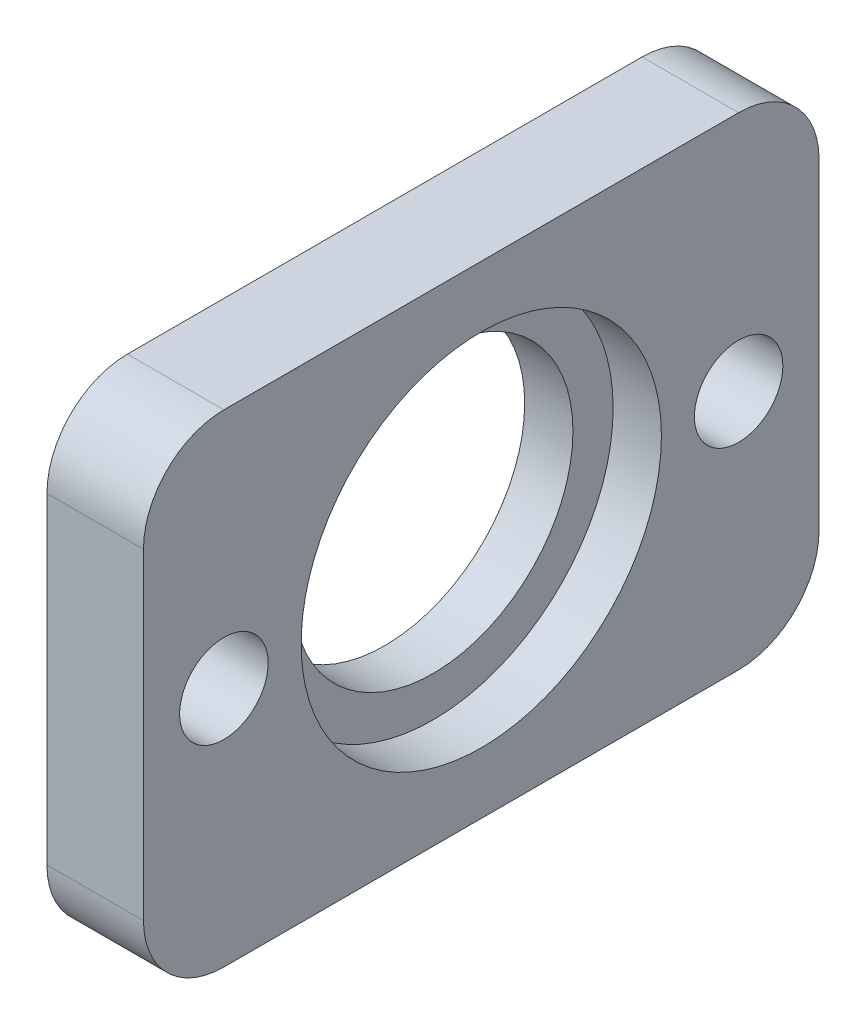
ISO-10303-21;
HEADER;
FILE_DESCRIPTION(('STEP AP214'),'2;1');
FILE_NAME('part.step','',(''),(''),'','','');
FILE_SCHEMA(('AUTOMOTIVE_DESIGN { 1 0 10303 214 1 1 1 1 }'));
ENDSEC;
DATA;
#1=APPLICATION_CONTEXT('core data for automotive mechanical design processes');
#2=APPLICATION_PROTOCOL_DEFINITION('international standard','automotive_design',2000,#1);
#3=PRODUCT_CONTEXT('',#1,'mechanical');
#4=PRODUCT('Part','Part','',(#3));
#5=PRODUCT_RELATED_PRODUCT_CATEGORY('part','',(#4));
#6=PRODUCT_DEFINITION_FORMATION('','',#4);
#7=PRODUCT_DEFINITION_CONTEXT('part definition',#1,'design');
#8=PRODUCT_DEFINITION('design','',#6,#7);
#9=PRODUCT_DEFINITION_SHAPE('','',#8);
#10=(LENGTH_UNIT() NAMED_UNIT(*) SI_UNIT(.MILLI.,.METRE.));
#11=(NAMED_UNIT(*) PLANE_ANGLE_UNIT() SI_UNIT($,.RADIAN.));
#12=(NAMED_UNIT(*) SI_UNIT($,.STERADIAN.) SOLID_ANGLE_UNIT());
#13=UNCERTAINTY_MEASURE_WITH_UNIT(LENGTH_MEASURE(1.E-05),#10,'distance_accuracy_value','');
#14=(GEOMETRIC_REPRESENTATION_CONTEXT(3) GLOBAL_UNCERTAINTY_ASSIGNED_CONTEXT((#13)) GLOBAL_UNIT_ASSIGNED_CONTEXT((#10,
#11,#12)) REPRESENTATION_CONTEXT('',''));
#15=CARTESIAN_POINT('',(0.,0.,0.));
#16=DIRECTION('',(0.,0.,1.));
#17=DIRECTION('',(1.,0.,0.));
#18=AXIS2_PLACEMENT_3D('',#15,#16,#17);
#19=CARTESIAN_POINT('',(-6.,0.,0.));
#20=DIRECTION('',(1.,0.,0.));
#21=DIRECTION('',(0.,0.,-1.));
#22=AXIS2_PLACEMENT_3D('',#19,#20,#21);
#23=CYLINDRICAL_SURFACE('',#22,8.7);
#24=CARTESIAN_POINT('',(-6.,0.,0.));
#25=DIRECTION('',(1.,0.,0.));
#26=DIRECTION('',(0.,0.,-1.));
#27=AXIS2_PLACEMENT_3D('',#24,#25,#26);
#28=CIRCLE('',#27,8.7);
#29=CARTESIAN_POINT('',(-6.,0.,-8.7));
#30=VERTEX_POINT('',#29);
#31=EDGE_CURVE('E168',#30,#30,#28,.T.);
#32=ORIENTED_EDGE('',*,*,#31,.F.);
#33=EDGE_LOOP('',(#32));
#34=FACE_BOUND('',#33,.T.);
#35=CARTESIAN_POINT('',(-3.,0.,0.));
#36=DIRECTION('',(1.,0.,0.));
#37=DIRECTION('',(0.,0.,-1.));
#38=AXIS2_PLACEMENT_3D('',#35,#36,#37);
#39=CIRCLE('',#38,8.7);
#40=CARTESIAN_POINT('',(-3.,0.,-8.7));
#41=VERTEX_POINT('',#40);
#42=EDGE_CURVE('E138',#41,#41,#39,.F.);
#43=ORIENTED_EDGE('',*,*,#42,.F.);
#44=EDGE_LOOP('',(#43));
#45=FACE_BOUND('',#44,.T.);
#46=ADVANCED_FACE('F39',(#34,#45),#23,.F.);
#47=CARTESIAN_POINT('',(-6.,-15.,-21.));
#48=DIRECTION('',(0.,0.,-1.));
#49=DIRECTION('',(0.,1.,0.));
#50=AXIS2_PLACEMENT_3D('',#47,#48,#49);
#51=PLANE('',#50);
#52=DIRECTION('',(0.,1.,0.));
#53=VECTOR('',#52,1.);
#54=CARTESIAN_POINT('',(-6.,-15.,-21.));
#55=LINE('',#54,#53);
#56=CARTESIAN_POINT('',(-6.,-10.,-21.));
#57=VERTEX_POINT('',#56);
#58=CARTESIAN_POINT('',(-6.,10.,-21.));
#59=VERTEX_POINT('',#58);
#60=EDGE_CURVE('E162',#57,#59,#55,.T.);
#61=ORIENTED_EDGE('',*,*,#60,.T.);
#62=DIRECTION('',(1.,0.,0.));
#63=VECTOR('',#62,1.);
#64=CARTESIAN_POINT('',(-6.,10.,-21.));
#65=LINE('',#64,#63);
#66=CARTESIAN_POINT('',(0.,10.,-21.));
#67=VERTEX_POINT('',#66);
#68=EDGE_CURVE('E157',#59,#67,#65,.T.);
#69=ORIENTED_EDGE('',*,*,#68,.T.);
#70=DIRECTION('',(0.,1.,0.));
#71=VECTOR('',#70,1.);
#72=CARTESIAN_POINT('',(0.,-15.,-21.));
#73=LINE('',#72,#71);
#74=CARTESIAN_POINT('',(0.,-10.,-21.));
#75=VERTEX_POINT('',#74);
#76=EDGE_CURVE('E110',#75,#67,#73,.T.);
#77=ORIENTED_EDGE('',*,*,#76,.F.);
#78=DIRECTION('',(1.,0.,0.));
#79=VECTOR('',#78,1.);
#80=CARTESIAN_POINT('',(-6.,-10.,-21.));
#81=LINE('',#80,#79);
#82=EDGE_CURVE('E155',#75,#57,#81,.F.);
#83=ORIENTED_EDGE('',*,*,#82,.T.);
#84=EDGE_LOOP('',(#61,#69,#77,#83));
#85=FACE_BOUND('',#84,.T.);
#86=ADVANCED_FACE('F160',(#85),#51,.T.);
#87=CARTESIAN_POINT('',(-6.,-15.,-21.));
#88=DIRECTION('',(0.,1.,0.));
#89=DIRECTION('',(0.,0.,1.));
#90=AXIS2_PLACEMENT_3D('',#87,#88,#89);
#91=PLANE('',#90);
#92=DIRECTION('',(0.,0.,1.));
#93=VECTOR('',#92,1.);
#94=CARTESIAN_POINT('',(-6.,-15.,-21.));
#95=LINE('',#94,#93);
#96=CARTESIAN_POINT('',(-6.,-15.,-16.));
#97=VERTEX_POINT('',#96);
#98=CARTESIAN_POINT('',(-6.,-15.,16.));
#99=VERTEX_POINT('',#98);
#100=EDGE_CURVE('E131',#97,#99,#95,.T.);
#101=ORIENTED_EDGE('',*,*,#100,.F.);
#102=DIRECTION('',(1.,0.,0.));
#103=VECTOR('',#102,1.);
#104=CARTESIAN_POINT('',(0.,-15.,-16.));
#105=LINE('',#104,#103);
#106=CARTESIAN_POINT('',(0.,-15.,-16.));
#107=VERTEX_POINT('',#106);
#108=EDGE_CURVE('E12',#97,#107,#105,.T.);
#109=ORIENTED_EDGE('',*,*,#108,.T.);
#110=DIRECTION('',(0.,0.,1.));
#111=VECTOR('',#110,1.);
#112=CARTESIAN_POINT('',(0.,-15.,-21.));
#113=LINE('',#112,#111);
#114=CARTESIAN_POINT('',(0.,-15.,16.));
#115=VERTEX_POINT('',#114);
#116=EDGE_CURVE('E164',#107,#115,#113,.T.);
#117=ORIENTED_EDGE('',*,*,#116,.T.);
#118=DIRECTION('',(1.,0.,0.));
#119=VECTOR('',#118,1.);
#120=CARTESIAN_POINT('',(-6.,-15.,16.));
#121=LINE('',#120,#119);
#122=EDGE_CURVE('E47',#115,#99,#121,.F.);
#123=ORIENTED_EDGE('',*,*,#122,.T.);
#124=EDGE_LOOP('',(#101,#109,#117,#123));
#125=FACE_BOUND('',#124,.T.);
#126=ADVANCED_FACE('F188',(#125),#91,.F.);
#127=CARTESIAN_POINT('',(-6.,-15.,21.));
#128=DIRECTION('',(0.,0.,-1.));
#129=DIRECTION('',(-1.,0.,0.));
#130=AXIS2_PLACEMENT_3D('',#127,#128,#129);
#131=PLANE('',#130);
#132=DIRECTION('',(0.,1.,0.));
#133=VECTOR('',#132,1.);
#134=CARTESIAN_POINT('',(0.,-15.,21.));
#135=LINE('',#134,#133);
#136=CARTESIAN_POINT('',(0.,-10.,21.));
#137=VERTEX_POINT('',#136);
#138=CARTESIAN_POINT('',(0.,10.,21.));
#139=VERTEX_POINT('',#138);
#140=EDGE_CURVE('E126',#137,#139,#135,.T.);
#141=ORIENTED_EDGE('',*,*,#140,.T.);
#142=DIRECTION('',(1.,0.,0.));
#143=VECTOR('',#142,1.);
#144=CARTESIAN_POINT('',(-6.,10.,21.));
#145=LINE('',#144,#143);
#146=CARTESIAN_POINT('',(-6.,10.,21.));
#147=VERTEX_POINT('',#146);
#148=EDGE_CURVE('E147',#139,#147,#145,.F.);
#149=ORIENTED_EDGE('',*,*,#148,.T.);
#150=DIRECTION('',(0.,1.,0.));
#151=VECTOR('',#150,1.);
#152=CARTESIAN_POINT('',(-6.,-15.,21.));
#153=LINE('',#152,#151);
#154=CARTESIAN_POINT('',(-6.,-10.,21.));
#155=VERTEX_POINT('',#154);
#156=EDGE_CURVE('E135',#155,#147,#153,.T.);
#157=ORIENTED_EDGE('',*,*,#156,.F.);
#158=DIRECTION('',(1.,0.,0.));
#159=VECTOR('',#158,1.);
#160=CARTESIAN_POINT('',(-6.,-10.,21.));
#161=LINE('',#160,#159);
#162=EDGE_CURVE('E144',#155,#137,#161,.T.);
#163=ORIENTED_EDGE('',*,*,#162,.T.);
#164=EDGE_LOOP('',(#141,#149,#157,#163));
#165=FACE_BOUND('',#164,.T.);
#166=ADVANCED_FACE('F178',(#165),#131,.F.);
#167=CARTESIAN_POINT('',(-6.,15.,-21.));
#168=DIRECTION('',(0.,1.,0.));
#169=DIRECTION('',(0.,0.,1.));
#170=AXIS2_PLACEMENT_3D('',#167,#168,#169);
#171=PLANE('',#170);
#172=DIRECTION('',(0.,0.,1.));
#173=VECTOR('',#172,1.);
#174=CARTESIAN_POINT('',(-6.,15.,-21.));
#175=LINE('',#174,#173);
#176=CARTESIAN_POINT('',(-6.,15.,-16.));
#177=VERTEX_POINT('',#176);
#178=CARTESIAN_POINT('',(-6.,15.,16.));
#179=VERTEX_POINT('',#178);
#180=EDGE_CURVE('E163',#177,#179,#175,.T.);
#181=ORIENTED_EDGE('',*,*,#180,.T.);
#182=DIRECTION('',(1.,0.,0.));
#183=VECTOR('',#182,1.);
#184=CARTESIAN_POINT('',(0.,15.,16.));
#185=LINE('',#184,#183);
#186=CARTESIAN_POINT('',(0.,15.,16.));
#187=VERTEX_POINT('',#186);
#188=EDGE_CURVE('E125',#179,#187,#185,.T.);
#189=ORIENTED_EDGE('',*,*,#188,.T.);
#190=DIRECTION('',(0.,0.,1.));
#191=VECTOR('',#190,1.);
#192=CARTESIAN_POINT('',(0.,15.,-21.));
#193=LINE('',#192,#191);
#194=CARTESIAN_POINT('',(0.,15.,-16.));
#195=VERTEX_POINT('',#194);
#196=EDGE_CURVE('E108',#195,#187,#193,.T.);
#197=ORIENTED_EDGE('',*,*,#196,.F.);
#198=DIRECTION('',(1.,0.,0.));
#199=VECTOR('',#198,1.);
#200=CARTESIAN_POINT('',(-6.,15.,-16.));
#201=LINE('',#200,#199);
#202=EDGE_CURVE('E122',#195,#177,#201,.F.);
#203=ORIENTED_EDGE('',*,*,#202,.T.);
#204=EDGE_LOOP('',(#181,#189,#197,#203));
#205=FACE_BOUND('',#204,.T.);
#206=ADVANCED_FACE('F121',(#205),#171,.T.);
#207=CARTESIAN_POINT('',(-6.,0.,0.));
#208=DIRECTION('',(1.,0.,0.));
#209=DIRECTION('',(0.,0.,-1.));
#210=AXIS2_PLACEMENT_3D('',#207,#208,#209);
#211=PLANE('',#210);
#212=CARTESIAN_POINT('',(-6.,0.,16.));
#213=DIRECTION('',(1.,0.,0.));
#214=DIRECTION('',(0.,0.,-1.));
#215=AXIS2_PLACEMENT_3D('',#212,#213,#214);
#216=CIRCLE('',#215,2.75);
#217=CARTESIAN_POINT('',(-6.,0.,13.25));
#218=VERTEX_POINT('',#217);
#219=EDGE_CURVE('E262',#218,#218,#216,.T.);
#220=ORIENTED_EDGE('',*,*,#219,.T.);
#221=EDGE_LOOP('',(#220));
#222=FACE_BOUND('',#221,.T.);
#223=CARTESIAN_POINT('',(-6.,0.,-16.));
#224=DIRECTION('',(1.,0.,0.));
#225=DIRECTION('',(0.,0.,-1.));
#226=AXIS2_PLACEMENT_3D('',#223,#224,#225);
#227=CIRCLE('',#226,2.75);
#228=CARTESIAN_POINT('',(-6.,0.,-18.75));
#229=VERTEX_POINT('',#228);
#230=EDGE_CURVE('E255',#229,#229,#227,.T.);
#231=ORIENTED_EDGE('',*,*,#230,.T.);
#232=EDGE_LOOP('',(#231));
#233=FACE_BOUND('',#232,.T.);
#234=ORIENTED_EDGE('',*,*,#31,.T.);
#235=EDGE_LOOP('',(#234));
#236=FACE_BOUND('',#235,.T.);
#237=ORIENTED_EDGE('',*,*,#156,.T.);
#238=CARTESIAN_POINT('',(-6.,10.,16.));
#239=DIRECTION('',(1.,0.,0.));
#240=DIRECTION('',(0.,0.,-1.));
#241=AXIS2_PLACEMENT_3D('',#238,#239,#240);
#242=CIRCLE('',#241,5.);
#243=EDGE_CURVE('E153',#147,#179,#242,.F.);
#244=ORIENTED_EDGE('',*,*,#243,.T.);
#245=ORIENTED_EDGE('',*,*,#180,.F.);
#246=CARTESIAN_POINT('',(-6.,10.,-16.));
#247=DIRECTION('',(1.,0.,0.));
#248=DIRECTION('',(0.,0.,-1.));
#249=AXIS2_PLACEMENT_3D('',#246,#247,#248);
#250=CIRCLE('',#249,5.);
#251=EDGE_CURVE('E130',#177,#59,#250,.F.);
#252=ORIENTED_EDGE('',*,*,#251,.T.);
#253=ORIENTED_EDGE('',*,*,#60,.F.);
#254=CARTESIAN_POINT('',(-6.,-10.,-16.));
#255=DIRECTION('',(1.,0.,0.));
#256=DIRECTION('',(0.,0.,-1.));
#257=AXIS2_PLACEMENT_3D('',#254,#255,#256);
#258=CIRCLE('',#257,5.);
#259=EDGE_CURVE('E60',#57,#97,#258,.F.);
#260=ORIENTED_EDGE('',*,*,#259,.T.);
#261=ORIENTED_EDGE('',*,*,#100,.T.);
#262=CARTESIAN_POINT('',(-6.,-10.,16.));
#263=DIRECTION('',(1.,0.,0.));
#264=DIRECTION('',(0.,0.,-1.));
#265=AXIS2_PLACEMENT_3D('',#262,#263,#264);
#266=CIRCLE('',#265,5.);
#267=EDGE_CURVE('E149',#99,#155,#266,.F.);
#268=ORIENTED_EDGE('',*,*,#267,.T.);
#269=EDGE_LOOP('',(#237,#244,#245,#252,#253,#260,#261,#268));
#270=FACE_BOUND('',#269,.T.);
#271=ADVANCED_FACE('F184',(#222,#233,#236,#270),#211,.F.);
#272=CARTESIAN_POINT('',(0.,0.,0.));
#273=DIRECTION('',(1.,0.,0.));
#274=DIRECTION('',(0.,0.,-1.));
#275=AXIS2_PLACEMENT_3D('',#272,#273,#274);
#276=PLANE('',#275);
#277=CARTESIAN_POINT('',(0.,0.,16.));
#278=DIRECTION('',(1.,0.,0.));
#279=DIRECTION('',(0.,0.,-1.));
#280=AXIS2_PLACEMENT_3D('',#277,#278,#279);
#281=CIRCLE('',#280,2.74999999999999);
#282=CARTESIAN_POINT('',(0.,0.,13.25));
#283=VERTEX_POINT('',#282);
#284=EDGE_CURVE('E265',#283,#283,#281,.T.);
#285=ORIENTED_EDGE('',*,*,#284,.F.);
#286=EDGE_LOOP('',(#285));
#287=FACE_BOUND('',#286,.T.);
#288=CARTESIAN_POINT('',(0.,0.,-16.));
#289=DIRECTION('',(1.,0.,0.));
#290=DIRECTION('',(0.,0.,-1.));
#291=AXIS2_PLACEMENT_3D('',#288,#289,#290);
#292=CIRCLE('',#291,2.74999999999999);
#293=CARTESIAN_POINT('',(0.,0.,-18.75));
#294=VERTEX_POINT('',#293);
#295=EDGE_CURVE('E259',#294,#294,#292,.T.);
#296=ORIENTED_EDGE('',*,*,#295,.F.);
#297=EDGE_LOOP('',(#296));
#298=FACE_BOUND('',#297,.T.);
#299=CARTESIAN_POINT('',(0.,0.,0.));
#300=DIRECTION('',(1.,0.,0.));
#301=DIRECTION('',(0.,0.,-1.));
#302=AXIS2_PLACEMENT_3D('',#299,#300,#301);
#303=CIRCLE('',#302,11.2);
#304=CARTESIAN_POINT('',(0.,0.,-11.2));
#305=VERTEX_POINT('',#304);
#306=EDGE_CURVE('E252',#305,#305,#303,.T.);
#307=ORIENTED_EDGE('',*,*,#306,.F.);
#308=EDGE_LOOP('',(#307));
#309=FACE_BOUND('',#308,.T.);
#310=ORIENTED_EDGE('',*,*,#196,.T.);
#311=CARTESIAN_POINT('',(0.,10.,16.));
#312=DIRECTION('',(1.,0.,0.));
#313=DIRECTION('',(0.,0.,-1.));
#314=AXIS2_PLACEMENT_3D('',#311,#312,#313);
#315=CIRCLE('',#314,5.);
#316=EDGE_CURVE('E115',#187,#139,#315,.T.);
#317=ORIENTED_EDGE('',*,*,#316,.T.);
#318=ORIENTED_EDGE('',*,*,#140,.F.);
#319=CARTESIAN_POINT('',(0.,-10.,16.));
#320=DIRECTION('',(1.,0.,0.));
#321=DIRECTION('',(0.,0.,-1.));
#322=AXIS2_PLACEMENT_3D('',#319,#320,#321);
#323=CIRCLE('',#322,5.);
#324=EDGE_CURVE('E133',#137,#115,#323,.T.);
#325=ORIENTED_EDGE('',*,*,#324,.T.);
#326=ORIENTED_EDGE('',*,*,#116,.F.);
#327=CARTESIAN_POINT('',(0.,-10.,-16.));
#328=DIRECTION('',(1.,0.,0.));
#329=DIRECTION('',(0.,0.,-1.));
#330=AXIS2_PLACEMENT_3D('',#327,#328,#329);
#331=CIRCLE('',#330,5.);
#332=EDGE_CURVE('E116',#107,#75,#331,.T.);
#333=ORIENTED_EDGE('',*,*,#332,.T.);
#334=ORIENTED_EDGE('',*,*,#76,.T.);
#335=CARTESIAN_POINT('',(0.,10.,-16.));
#336=DIRECTION('',(1.,0.,0.));
#337=DIRECTION('',(0.,0.,-1.));
#338=AXIS2_PLACEMENT_3D('',#335,#336,#337);
#339=CIRCLE('',#338,5.);
#340=EDGE_CURVE('E105',#67,#195,#339,.T.);
#341=ORIENTED_EDGE('',*,*,#340,.T.);
#342=EDGE_LOOP('',(#310,#317,#318,#325,#326,#333,#334,#341));
#343=FACE_BOUND('',#342,.T.);
#344=ADVANCED_FACE('F107',(#287,#298,#309,#343),#276,.T.);
#345=CARTESIAN_POINT('',(-3.,0.,0.));
#346=DIRECTION('',(1.,0.,0.));
#347=DIRECTION('',(0.,0.,-1.));
#348=AXIS2_PLACEMENT_3D('',#345,#346,#347);
#349=PLANE('',#348);
#350=CARTESIAN_POINT('',(-3.,0.,0.));
#351=DIRECTION('',(1.,0.,0.));
#352=DIRECTION('',(0.,0.,-1.));
#353=AXIS2_PLACEMENT_3D('',#350,#351,#352);
#354=CIRCLE('',#353,11.2);
#355=CARTESIAN_POINT('',(-3.,0.,-11.2));
#356=VERTEX_POINT('',#355);
#357=EDGE_CURVE('E248',#356,#356,#354,.T.);
#358=ORIENTED_EDGE('',*,*,#357,.T.);
#359=EDGE_LOOP('',(#358));
#360=FACE_BOUND('',#359,.T.);
#361=ORIENTED_EDGE('',*,*,#42,.T.);
#362=EDGE_LOOP('',(#361));
#363=FACE_BOUND('',#362,.T.);
#364=ADVANCED_FACE('F216',(#360,#363),#349,.T.);
#365=CARTESIAN_POINT('',(-3.,0.,0.));
#366=DIRECTION('',(1.,0.,0.));
#367=DIRECTION('',(0.,0.,-1.));
#368=AXIS2_PLACEMENT_3D('',#365,#366,#367);
#369=CYLINDRICAL_SURFACE('',#368,11.2);
#370=ORIENTED_EDGE('',*,*,#357,.F.);
#371=EDGE_LOOP('',(#370));
#372=FACE_BOUND('',#371,.T.);
#373=ORIENTED_EDGE('',*,*,#306,.T.);
#374=EDGE_LOOP('',(#373));
#375=FACE_BOUND('',#374,.T.);
#376=ADVANCED_FACE('F209',(#372,#375),#369,.F.);
#377=CARTESIAN_POINT('',(0.,0.,-16.));
#378=DIRECTION('',(1.,0.,0.));
#379=DIRECTION('',(0.,0.,-1.));
#380=AXIS2_PLACEMENT_3D('',#377,#378,#379);
#381=CYLINDRICAL_SURFACE('',#380,2.74999999999999);
#382=ORIENTED_EDGE('',*,*,#230,.F.);
#383=EDGE_LOOP('',(#382));
#384=FACE_BOUND('',#383,.T.);
#385=ORIENTED_EDGE('',*,*,#295,.T.);
#386=EDGE_LOOP('',(#385));
#387=FACE_BOUND('',#386,.T.);
#388=ADVANCED_FACE('F229',(#384,#387),#381,.F.);
#389=CARTESIAN_POINT('',(0.,0.,16.));
#390=DIRECTION('',(1.,0.,0.));
#391=DIRECTION('',(0.,0.,-1.));
#392=AXIS2_PLACEMENT_3D('',#389,#390,#391);
#393=CYLINDRICAL_SURFACE('',#392,2.74999999999999);
#394=ORIENTED_EDGE('',*,*,#219,.F.);
#395=EDGE_LOOP('',(#394));
#396=FACE_BOUND('',#395,.T.);
#397=ORIENTED_EDGE('',*,*,#284,.T.);
#398=EDGE_LOOP('',(#397));
#399=FACE_BOUND('',#398,.T.);
#400=ADVANCED_FACE('F225',(#396,#399),#393,.F.);
#401=CARTESIAN_POINT('',(-6.,10.,16.));
#402=DIRECTION('',(-1.,0.,0.));
#403=DIRECTION('',(0.,0.,1.));
#404=AXIS2_PLACEMENT_3D('',#401,#402,#403);
#405=CYLINDRICAL_SURFACE('',#404,5.);
#406=ORIENTED_EDGE('',*,*,#243,.F.);
#407=ORIENTED_EDGE('',*,*,#148,.F.);
#408=ORIENTED_EDGE('',*,*,#316,.F.);
#409=ORIENTED_EDGE('',*,*,#188,.F.);
#410=EDGE_LOOP('',(#406,#407,#408,#409));
#411=FACE_BOUND('',#410,.T.);
#412=ADVANCED_FACE('F183',(#411),#405,.T.);
#413=CARTESIAN_POINT('',(-6.,10.,-16.));
#414=DIRECTION('',(1.,0.,0.));
#415=DIRECTION('',(0.,0.,-1.));
#416=AXIS2_PLACEMENT_3D('',#413,#414,#415);
#417=CYLINDRICAL_SURFACE('',#416,5.);
#418=ORIENTED_EDGE('',*,*,#251,.F.);
#419=ORIENTED_EDGE('',*,*,#202,.F.);
#420=ORIENTED_EDGE('',*,*,#340,.F.);
#421=ORIENTED_EDGE('',*,*,#68,.F.);
#422=EDGE_LOOP('',(#418,#419,#420,#421));
#423=FACE_BOUND('',#422,.T.);
#424=ADVANCED_FACE('F129',(#423),#417,.T.);
#425=CARTESIAN_POINT('',(-6.,-10.,-16.));
#426=DIRECTION('',(-1.,0.,0.));
#427=DIRECTION('',(0.,0.,1.));
#428=AXIS2_PLACEMENT_3D('',#425,#426,#427);
#429=CYLINDRICAL_SURFACE('',#428,5.);
#430=ORIENTED_EDGE('',*,*,#259,.F.);
#431=ORIENTED_EDGE('',*,*,#82,.F.);
#432=ORIENTED_EDGE('',*,*,#332,.F.);
#433=ORIENTED_EDGE('',*,*,#108,.F.);
#434=EDGE_LOOP('',(#430,#431,#432,#433));
#435=FACE_BOUND('',#434,.T.);
#436=ADVANCED_FACE('F191',(#435),#429,.T.);
#437=CARTESIAN_POINT('',(-6.,-10.,16.));
#438=DIRECTION('',(1.,0.,0.));
#439=DIRECTION('',(0.,0.,-1.));
#440=AXIS2_PLACEMENT_3D('',#437,#438,#439);
#441=CYLINDRICAL_SURFACE('',#440,5.);
#442=ORIENTED_EDGE('',*,*,#267,.F.);
#443=ORIENTED_EDGE('',*,*,#122,.F.);
#444=ORIENTED_EDGE('',*,*,#324,.F.);
#445=ORIENTED_EDGE('',*,*,#162,.F.);
#446=EDGE_LOOP('',(#442,#443,#444,#445));
#447=FACE_BOUND('',#446,.T.);
#448=ADVANCED_FACE('F41',(#447),#441,.T.);
#449=CLOSED_SHELL('',(#46,#86,#126,#166,#206,#271,#344,#364,#376,#388,#400,#412,#424,#436,#448));
#450=MANIFOLD_SOLID_BREP('B2',#449);
#451=ADVANCED_BREP_SHAPE_REPRESENTATION('',(#18,#450),#14);
#452=SHAPE_DEFINITION_REPRESENTATION(#9,#451);
ENDSEC;
END-ISO-10303-21;
